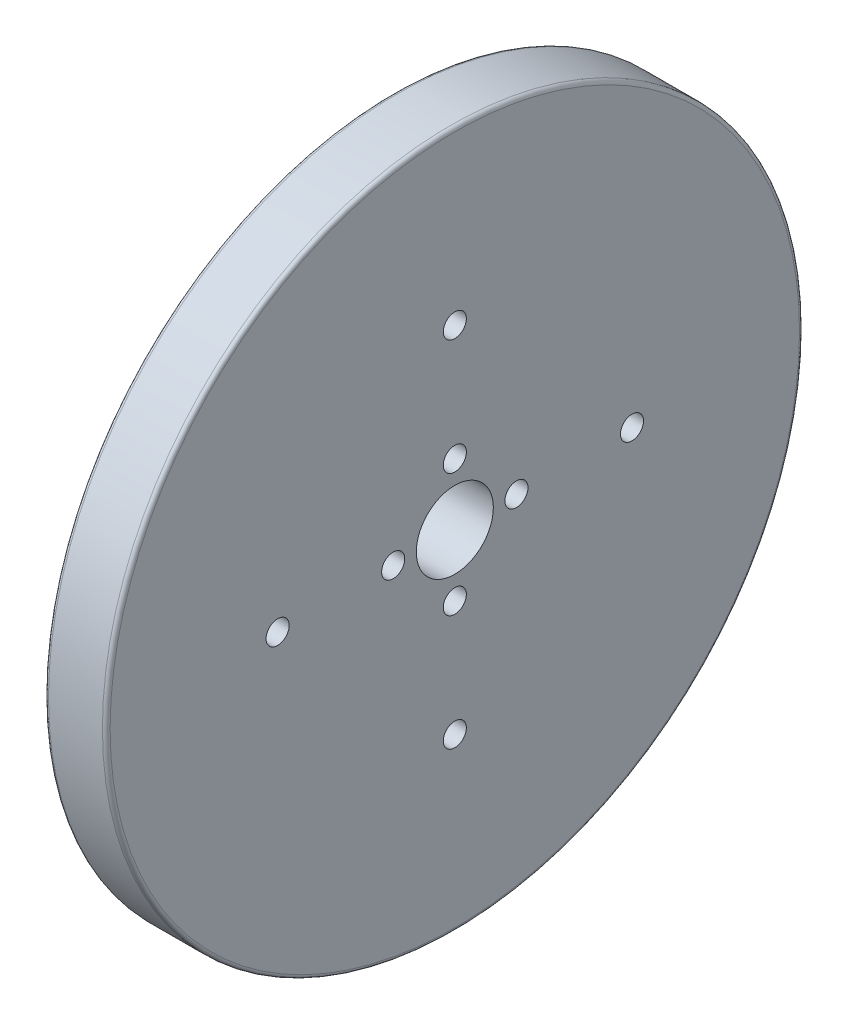
ISO-10303-21;
HEADER;
FILE_DESCRIPTION(('STEP AP214'),'2;1');
FILE_NAME('part.step','',(''),(''),'','','');
FILE_SCHEMA(('AUTOMOTIVE_DESIGN { 1 0 10303 214 1 1 1 1 }'));
ENDSEC;
DATA;
#1=APPLICATION_CONTEXT('core data for automotive mechanical design processes');
#2=APPLICATION_PROTOCOL_DEFINITION('international standard','automotive_design',2000,#1);
#3=PRODUCT_CONTEXT('',#1,'mechanical');
#4=PRODUCT('Part','Part','',(#3));
#5=PRODUCT_RELATED_PRODUCT_CATEGORY('part','',(#4));
#6=PRODUCT_DEFINITION_FORMATION('','',#4);
#7=PRODUCT_DEFINITION_CONTEXT('part definition',#1,'design');
#8=PRODUCT_DEFINITION('design','',#6,#7);
#9=PRODUCT_DEFINITION_SHAPE('','',#8);
#10=(LENGTH_UNIT() NAMED_UNIT(*) SI_UNIT(.MILLI.,.METRE.));
#11=(NAMED_UNIT(*) PLANE_ANGLE_UNIT() SI_UNIT($,.RADIAN.));
#12=(NAMED_UNIT(*) SI_UNIT($,.STERADIAN.) SOLID_ANGLE_UNIT());
#13=UNCERTAINTY_MEASURE_WITH_UNIT(LENGTH_MEASURE(1.E-05),#10,'distance_accuracy_value','');
#14=(GEOMETRIC_REPRESENTATION_CONTEXT(3) GLOBAL_UNCERTAINTY_ASSIGNED_CONTEXT((#13)) GLOBAL_UNIT_ASSIGNED_CONTEXT((#10,
#11,#12)) REPRESENTATION_CONTEXT('',''));
#15=CARTESIAN_POINT('',(0.,0.,0.));
#16=DIRECTION('',(0.,0.,1.));
#17=DIRECTION('',(1.,0.,0.));
#18=AXIS2_PLACEMENT_3D('',#15,#16,#17);
#19=CARTESIAN_POINT('',(8.,0.,0.));
#20=DIRECTION('',(-1.,0.,0.));
#21=DIRECTION('',(0.,0.,1.));
#22=AXIS2_PLACEMENT_3D('',#19,#20,#21);
#23=CYLINDRICAL_SURFACE('',#22,45.25);
#24=CARTESIAN_POINT('',(0.5,0.,0.));
#25=DIRECTION('',(1.,0.,0.));
#26=DIRECTION('',(0.,0.,-1.));
#27=AXIS2_PLACEMENT_3D('',#24,#25,#26);
#28=CIRCLE('',#27,45.25);
#29=CARTESIAN_POINT('',(0.5,0.,-45.25));
#30=VERTEX_POINT('',#29);
#31=EDGE_CURVE('E44',#30,#30,#28,.T.);
#32=ORIENTED_EDGE('',*,*,#31,.T.);
#33=EDGE_LOOP('',(#32));
#34=FACE_BOUND('',#33,.T.);
#35=CARTESIAN_POINT('',(7.5,0.,0.));
#36=DIRECTION('',(1.,0.,0.));
#37=DIRECTION('',(0.,0.,-1.));
#38=AXIS2_PLACEMENT_3D('',#35,#36,#37);
#39=CIRCLE('',#38,45.25);
#40=CARTESIAN_POINT('',(7.5,0.,-45.25));
#41=VERTEX_POINT('',#40);
#42=EDGE_CURVE('E48',#41,#41,#39,.F.);
#43=ORIENTED_EDGE('',*,*,#42,.T.);
#44=EDGE_LOOP('',(#43));
#45=FACE_BOUND('',#44,.T.);
#46=ADVANCED_FACE('F33',(#34,#45),#23,.T.);
#47=CARTESIAN_POINT('',(8.,0.,0.));
#48=DIRECTION('',(1.,0.,0.));
#49=DIRECTION('',(0.,0.,-1.));
#50=AXIS2_PLACEMENT_3D('',#47,#48,#49);
#51=PLANE('',#50);
#52=CARTESIAN_POINT('',(8.,0.,0.));
#53=DIRECTION('',(1.,0.,0.));
#54=DIRECTION('',(0.,0.,-1.));
#55=AXIS2_PLACEMENT_3D('',#52,#53,#54);
#56=CIRCLE('',#55,44.75);
#57=CARTESIAN_POINT('',(8.,0.,-44.75));
#58=VERTEX_POINT('',#57);
#59=EDGE_CURVE('E10',#58,#58,#56,.T.);
#60=ORIENTED_EDGE('',*,*,#59,.T.);
#61=EDGE_LOOP('',(#60));
#62=FACE_BOUND('',#61,.T.);
#63=CARTESIAN_POINT('',(8.,-6.53699316899292E-13,22.9999999999993));
#64=DIRECTION('',(1.,0.,0.));
#65=DIRECTION('',(0.,0.,-1.));
#66=AXIS2_PLACEMENT_3D('',#63,#64,#65);
#67=CIRCLE('',#66,1.50000000000105);
#68=CARTESIAN_POINT('',(8.,-6.53699316899292E-13,21.4999999999983));
#69=VERTEX_POINT('',#68);
#70=EDGE_CURVE('E99',#69,#69,#67,.T.);
#71=ORIENTED_EDGE('',*,*,#70,.F.);
#72=EDGE_LOOP('',(#71));
#73=FACE_BOUND('',#72,.T.);
#74=CARTESIAN_POINT('',(8.,0.,8.));
#75=DIRECTION('',(1.,0.,0.));
#76=DIRECTION('',(0.,0.,-1.));
#77=AXIS2_PLACEMENT_3D('',#74,#75,#76);
#78=CIRCLE('',#77,1.5);
#79=CARTESIAN_POINT('',(8.,0.,6.5));
#80=VERTEX_POINT('',#79);
#81=EDGE_CURVE('E93',#80,#80,#78,.T.);
#82=ORIENTED_EDGE('',*,*,#81,.F.);
#83=EDGE_LOOP('',(#82));
#84=FACE_BOUND('',#83,.T.);
#85=CARTESIAN_POINT('',(8.,-23.,-1.30035691470349E-12));
#86=DIRECTION('',(1.,0.,0.));
#87=DIRECTION('',(0.,0.,-1.));
#88=AXIS2_PLACEMENT_3D('',#85,#86,#87);
#89=CIRCLE('',#88,1.5000000000014);
#90=CARTESIAN_POINT('',(8.,-23.,-1.5000000000027));
#91=VERTEX_POINT('',#90);
#92=EDGE_CURVE('E87',#91,#91,#89,.T.);
#93=ORIENTED_EDGE('',*,*,#92,.F.);
#94=EDGE_LOOP('',(#93));
#95=FACE_BOUND('',#94,.T.);
#96=CARTESIAN_POINT('',(8.,-8.,0.));
#97=DIRECTION('',(1.,0.,0.));
#98=DIRECTION('',(0.,0.,-1.));
#99=AXIS2_PLACEMENT_3D('',#96,#97,#98);
#100=CIRCLE('',#99,1.5);
#101=CARTESIAN_POINT('',(8.,-8.,-1.49999999999994));
#102=VERTEX_POINT('',#101);
#103=EDGE_CURVE('E81',#102,#102,#100,.T.);
#104=ORIENTED_EDGE('',*,*,#103,.F.);
#105=EDGE_LOOP('',(#104));
#106=FACE_BOUND('',#105,.T.);
#107=CARTESIAN_POINT('',(8.,0.,-23.));
#108=DIRECTION('',(1.,0.,0.));
#109=DIRECTION('',(0.,0.,-1.));
#110=AXIS2_PLACEMENT_3D('',#107,#108,#109);
#111=CIRCLE('',#110,1.5);
#112=CARTESIAN_POINT('',(8.,0.,-24.5));
#113=VERTEX_POINT('',#112);
#114=EDGE_CURVE('E75',#113,#113,#111,.T.);
#115=ORIENTED_EDGE('',*,*,#114,.F.);
#116=EDGE_LOOP('',(#115));
#117=FACE_BOUND('',#116,.T.);
#118=CARTESIAN_POINT('',(8.,0.,-8.));
#119=DIRECTION('',(1.,0.,0.));
#120=DIRECTION('',(0.,0.,-1.));
#121=AXIS2_PLACEMENT_3D('',#118,#119,#120);
#122=CIRCLE('',#121,1.5);
#123=CARTESIAN_POINT('',(8.,0.,-9.5));
#124=VERTEX_POINT('',#123);
#125=EDGE_CURVE('E69',#124,#124,#122,.T.);
#126=ORIENTED_EDGE('',*,*,#125,.F.);
#127=EDGE_LOOP('',(#126));
#128=FACE_BOUND('',#127,.T.);
#129=CARTESIAN_POINT('',(8.,8.,0.));
#130=DIRECTION('',(1.,0.,0.));
#131=DIRECTION('',(0.,0.,-1.));
#132=AXIS2_PLACEMENT_3D('',#129,#130,#131);
#133=CIRCLE('',#132,1.5);
#134=CARTESIAN_POINT('',(8.,8.,-1.5));
#135=VERTEX_POINT('',#134);
#136=EDGE_CURVE('E63',#135,#135,#133,.T.);
#137=ORIENTED_EDGE('',*,*,#136,.F.);
#138=EDGE_LOOP('',(#137));
#139=FACE_BOUND('',#138,.T.);
#140=CARTESIAN_POINT('',(8.,23.,0.));
#141=DIRECTION('',(1.,0.,0.));
#142=DIRECTION('',(0.,0.,-1.));
#143=AXIS2_PLACEMENT_3D('',#140,#141,#142);
#144=CIRCLE('',#143,1.5);
#145=CARTESIAN_POINT('',(8.,23.,-1.5));
#146=VERTEX_POINT('',#145);
#147=EDGE_CURVE('E57',#146,#146,#144,.T.);
#148=ORIENTED_EDGE('',*,*,#147,.F.);
#149=EDGE_LOOP('',(#148));
#150=FACE_BOUND('',#149,.T.);
#151=CARTESIAN_POINT('',(8.,0.,0.));
#152=DIRECTION('',(1.,0.,0.));
#153=DIRECTION('',(0.,0.,-1.));
#154=AXIS2_PLACEMENT_3D('',#151,#152,#153);
#155=CIRCLE('',#154,5.);
#156=CARTESIAN_POINT('',(8.,0.,-5.));
#157=VERTEX_POINT('',#156);
#158=EDGE_CURVE('E53',#157,#157,#155,.T.);
#159=ORIENTED_EDGE('',*,*,#158,.F.);
#160=EDGE_LOOP('',(#159));
#161=FACE_BOUND('',#160,.T.);
#162=ADVANCED_FACE('F111',(#62,#73,#84,#95,#106,#117,#128,#139,#150,#161),#51,.T.);
#163=CARTESIAN_POINT('',(0.,0.,0.));
#164=DIRECTION('',(1.,0.,0.));
#165=DIRECTION('',(0.,0.,-1.));
#166=AXIS2_PLACEMENT_3D('',#163,#164,#165);
#167=PLANE('',#166);
#168=CARTESIAN_POINT('',(0.,0.,0.));
#169=DIRECTION('',(1.,0.,0.));
#170=DIRECTION('',(0.,0.,-1.));
#171=AXIS2_PLACEMENT_3D('',#168,#169,#170);
#172=CIRCLE('',#171,44.75);
#173=CARTESIAN_POINT('',(0.,0.,-44.75));
#174=VERTEX_POINT('',#173);
#175=EDGE_CURVE('E40',#174,#174,#172,.F.);
#176=ORIENTED_EDGE('',*,*,#175,.T.);
#177=EDGE_LOOP('',(#176));
#178=FACE_BOUND('',#177,.T.);
#179=CARTESIAN_POINT('',(0.,-6.53699316899292E-13,22.9999999999993));
#180=DIRECTION('',(1.,0.,0.));
#181=DIRECTION('',(0.,0.,-1.));
#182=AXIS2_PLACEMENT_3D('',#179,#180,#181);
#183=CIRCLE('',#182,1.50000000000105);
#184=CARTESIAN_POINT('',(0.,-6.53699316899292E-13,21.4999999999983));
#185=VERTEX_POINT('',#184);
#186=EDGE_CURVE('E102',#185,#185,#183,.T.);
#187=ORIENTED_EDGE('',*,*,#186,.T.);
#188=EDGE_LOOP('',(#187));
#189=FACE_BOUND('',#188,.T.);
#190=CARTESIAN_POINT('',(0.,0.,8.));
#191=DIRECTION('',(1.,0.,0.));
#192=DIRECTION('',(0.,0.,-1.));
#193=AXIS2_PLACEMENT_3D('',#190,#191,#192);
#194=CIRCLE('',#193,1.5);
#195=CARTESIAN_POINT('',(0.,0.,6.5));
#196=VERTEX_POINT('',#195);
#197=EDGE_CURVE('E96',#196,#196,#194,.T.);
#198=ORIENTED_EDGE('',*,*,#197,.T.);
#199=EDGE_LOOP('',(#198));
#200=FACE_BOUND('',#199,.T.);
#201=CARTESIAN_POINT('',(0.,-23.,-1.30035691470349E-12));
#202=DIRECTION('',(1.,0.,0.));
#203=DIRECTION('',(0.,0.,-1.));
#204=AXIS2_PLACEMENT_3D('',#201,#202,#203);
#205=CIRCLE('',#204,1.5000000000014);
#206=CARTESIAN_POINT('',(0.,-23.,-1.5000000000027));
#207=VERTEX_POINT('',#206);
#208=EDGE_CURVE('E90',#207,#207,#205,.T.);
#209=ORIENTED_EDGE('',*,*,#208,.T.);
#210=EDGE_LOOP('',(#209));
#211=FACE_BOUND('',#210,.T.);
#212=CARTESIAN_POINT('',(0.,-8.,0.));
#213=DIRECTION('',(1.,0.,0.));
#214=DIRECTION('',(0.,0.,-1.));
#215=AXIS2_PLACEMENT_3D('',#212,#213,#214);
#216=CIRCLE('',#215,1.5);
#217=CARTESIAN_POINT('',(0.,-8.,-1.49999999999994));
#218=VERTEX_POINT('',#217);
#219=EDGE_CURVE('E84',#218,#218,#216,.T.);
#220=ORIENTED_EDGE('',*,*,#219,.T.);
#221=EDGE_LOOP('',(#220));
#222=FACE_BOUND('',#221,.T.);
#223=CARTESIAN_POINT('',(0.,0.,-23.));
#224=DIRECTION('',(1.,0.,0.));
#225=DIRECTION('',(0.,0.,-1.));
#226=AXIS2_PLACEMENT_3D('',#223,#224,#225);
#227=CIRCLE('',#226,1.5);
#228=CARTESIAN_POINT('',(0.,0.,-24.5));
#229=VERTEX_POINT('',#228);
#230=EDGE_CURVE('E78',#229,#229,#227,.T.);
#231=ORIENTED_EDGE('',*,*,#230,.T.);
#232=EDGE_LOOP('',(#231));
#233=FACE_BOUND('',#232,.T.);
#234=CARTESIAN_POINT('',(0.,0.,-8.));
#235=DIRECTION('',(1.,0.,0.));
#236=DIRECTION('',(0.,0.,-1.));
#237=AXIS2_PLACEMENT_3D('',#234,#235,#236);
#238=CIRCLE('',#237,1.5);
#239=CARTESIAN_POINT('',(0.,0.,-9.5));
#240=VERTEX_POINT('',#239);
#241=EDGE_CURVE('E72',#240,#240,#238,.T.);
#242=ORIENTED_EDGE('',*,*,#241,.T.);
#243=EDGE_LOOP('',(#242));
#244=FACE_BOUND('',#243,.T.);
#245=CARTESIAN_POINT('',(0.,8.,0.));
#246=DIRECTION('',(1.,0.,0.));
#247=DIRECTION('',(0.,0.,-1.));
#248=AXIS2_PLACEMENT_3D('',#245,#246,#247);
#249=CIRCLE('',#248,1.5);
#250=CARTESIAN_POINT('',(0.,8.,-1.5));
#251=VERTEX_POINT('',#250);
#252=EDGE_CURVE('E66',#251,#251,#249,.T.);
#253=ORIENTED_EDGE('',*,*,#252,.T.);
#254=EDGE_LOOP('',(#253));
#255=FACE_BOUND('',#254,.T.);
#256=CARTESIAN_POINT('',(0.,23.,0.));
#257=DIRECTION('',(1.,0.,0.));
#258=DIRECTION('',(0.,0.,-1.));
#259=AXIS2_PLACEMENT_3D('',#256,#257,#258);
#260=CIRCLE('',#259,1.5);
#261=CARTESIAN_POINT('',(0.,23.,-1.5));
#262=VERTEX_POINT('',#261);
#263=EDGE_CURVE('E60',#262,#262,#260,.T.);
#264=ORIENTED_EDGE('',*,*,#263,.T.);
#265=EDGE_LOOP('',(#264));
#266=FACE_BOUND('',#265,.T.);
#267=CARTESIAN_POINT('',(0.,0.,0.));
#268=DIRECTION('',(1.,0.,0.));
#269=DIRECTION('',(0.,0.,-1.));
#270=AXIS2_PLACEMENT_3D('',#267,#268,#269);
#271=CIRCLE('',#270,5.);
#272=CARTESIAN_POINT('',(0.,0.,-5.));
#273=VERTEX_POINT('',#272);
#274=EDGE_CURVE('E54',#273,#273,#271,.T.);
#275=ORIENTED_EDGE('',*,*,#274,.T.);
#276=EDGE_LOOP('',(#275));
#277=FACE_BOUND('',#276,.T.);
#278=ADVANCED_FACE('F114',(#178,#189,#200,#211,#222,#233,#244,#255,#266,#277),#167,.F.);
#279=CARTESIAN_POINT('',(8.,0.,0.));
#280=DIRECTION('',(-1.,0.,0.));
#281=DIRECTION('',(0.,0.,1.));
#282=AXIS2_PLACEMENT_3D('',#279,#280,#281);
#283=CYLINDRICAL_SURFACE('',#282,5.);
#284=ORIENTED_EDGE('',*,*,#158,.T.);
#285=EDGE_LOOP('',(#284));
#286=FACE_BOUND('',#285,.T.);
#287=ORIENTED_EDGE('',*,*,#274,.F.);
#288=EDGE_LOOP('',(#287));
#289=FACE_BOUND('',#288,.T.);
#290=ADVANCED_FACE('F132',(#286,#289),#283,.F.);
#291=CARTESIAN_POINT('',(8.,23.,0.));
#292=DIRECTION('',(-1.,0.,0.));
#293=DIRECTION('',(0.,0.,1.));
#294=AXIS2_PLACEMENT_3D('',#291,#292,#293);
#295=CYLINDRICAL_SURFACE('',#294,1.5);
#296=ORIENTED_EDGE('',*,*,#147,.T.);
#297=EDGE_LOOP('',(#296));
#298=FACE_BOUND('',#297,.T.);
#299=ORIENTED_EDGE('',*,*,#263,.F.);
#300=EDGE_LOOP('',(#299));
#301=FACE_BOUND('',#300,.T.);
#302=ADVANCED_FACE('F135',(#298,#301),#295,.F.);
#303=CARTESIAN_POINT('',(8.,8.,0.));
#304=DIRECTION('',(-1.,0.,0.));
#305=DIRECTION('',(0.,0.,1.));
#306=AXIS2_PLACEMENT_3D('',#303,#304,#305);
#307=CYLINDRICAL_SURFACE('',#306,1.5);
#308=ORIENTED_EDGE('',*,*,#136,.T.);
#309=EDGE_LOOP('',(#308));
#310=FACE_BOUND('',#309,.T.);
#311=ORIENTED_EDGE('',*,*,#252,.F.);
#312=EDGE_LOOP('',(#311));
#313=FACE_BOUND('',#312,.T.);
#314=ADVANCED_FACE('F183',(#310,#313),#307,.F.);
#315=CARTESIAN_POINT('',(8.,0.,-8.));
#316=DIRECTION('',(-1.,0.,0.));
#317=DIRECTION('',(0.,0.,1.));
#318=AXIS2_PLACEMENT_3D('',#315,#316,#317);
#319=CYLINDRICAL_SURFACE('',#318,1.5);
#320=ORIENTED_EDGE('',*,*,#125,.T.);
#321=EDGE_LOOP('',(#320));
#322=FACE_BOUND('',#321,.T.);
#323=ORIENTED_EDGE('',*,*,#241,.F.);
#324=EDGE_LOOP('',(#323));
#325=FACE_BOUND('',#324,.T.);
#326=ADVANCED_FACE('F179',(#322,#325),#319,.F.);
#327=CARTESIAN_POINT('',(8.,0.,-23.));
#328=DIRECTION('',(-1.,0.,0.));
#329=DIRECTION('',(0.,0.,1.));
#330=AXIS2_PLACEMENT_3D('',#327,#328,#329);
#331=CYLINDRICAL_SURFACE('',#330,1.5);
#332=ORIENTED_EDGE('',*,*,#114,.T.);
#333=EDGE_LOOP('',(#332));
#334=FACE_BOUND('',#333,.T.);
#335=ORIENTED_EDGE('',*,*,#230,.F.);
#336=EDGE_LOOP('',(#335));
#337=FACE_BOUND('',#336,.T.);
#338=ADVANCED_FACE('F175',(#334,#337),#331,.F.);
#339=CARTESIAN_POINT('',(8.,-8.,0.));
#340=DIRECTION('',(-1.,0.,0.));
#341=DIRECTION('',(0.,0.,1.));
#342=AXIS2_PLACEMENT_3D('',#339,#340,#341);
#343=CYLINDRICAL_SURFACE('',#342,1.5);
#344=ORIENTED_EDGE('',*,*,#103,.T.);
#345=EDGE_LOOP('',(#344));
#346=FACE_BOUND('',#345,.T.);
#347=ORIENTED_EDGE('',*,*,#219,.F.);
#348=EDGE_LOOP('',(#347));
#349=FACE_BOUND('',#348,.T.);
#350=ADVANCED_FACE('F171',(#346,#349),#343,.F.);
#351=CARTESIAN_POINT('',(8.,-23.,-1.30035691470349E-12));
#352=DIRECTION('',(-1.,0.,0.));
#353=DIRECTION('',(0.,0.,1.));
#354=AXIS2_PLACEMENT_3D('',#351,#352,#353);
#355=CYLINDRICAL_SURFACE('',#354,1.5000000000014);
#356=ORIENTED_EDGE('',*,*,#92,.T.);
#357=EDGE_LOOP('',(#356));
#358=FACE_BOUND('',#357,.T.);
#359=ORIENTED_EDGE('',*,*,#208,.F.);
#360=EDGE_LOOP('',(#359));
#361=FACE_BOUND('',#360,.T.);
#362=ADVANCED_FACE('F165',(#358,#361),#355,.F.);
#363=CARTESIAN_POINT('',(8.,0.,8.));
#364=DIRECTION('',(-1.,0.,0.));
#365=DIRECTION('',(0.,0.,1.));
#366=AXIS2_PLACEMENT_3D('',#363,#364,#365);
#367=CYLINDRICAL_SURFACE('',#366,1.5);
#368=ORIENTED_EDGE('',*,*,#81,.T.);
#369=EDGE_LOOP('',(#368));
#370=FACE_BOUND('',#369,.T.);
#371=ORIENTED_EDGE('',*,*,#197,.F.);
#372=EDGE_LOOP('',(#371));
#373=FACE_BOUND('',#372,.T.);
#374=ADVANCED_FACE('F158',(#370,#373),#367,.F.);
#375=CARTESIAN_POINT('',(8.,-6.53699316899292E-13,22.9999999999993));
#376=DIRECTION('',(-1.,0.,0.));
#377=DIRECTION('',(0.,0.,1.));
#378=AXIS2_PLACEMENT_3D('',#375,#376,#377);
#379=CYLINDRICAL_SURFACE('',#378,1.50000000000105);
#380=ORIENTED_EDGE('',*,*,#70,.T.);
#381=EDGE_LOOP('',(#380));
#382=FACE_BOUND('',#381,.T.);
#383=ORIENTED_EDGE('',*,*,#186,.F.);
#384=EDGE_LOOP('',(#383));
#385=FACE_BOUND('',#384,.T.);
#386=ADVANCED_FACE('F108',(#382,#385),#379,.F.);
#387=CARTESIAN_POINT('',(0.5,0.,0.));
#388=DIRECTION('',(1.,0.,0.));
#389=DIRECTION('',(0.,0.,-1.));
#390=AXIS2_PLACEMENT_3D('',#387,#388,#389);
#391=TOROIDAL_SURFACE('',#390,44.75,0.5);
#392=ORIENTED_EDGE('',*,*,#175,.F.);
#393=EDGE_LOOP('',(#392));
#394=FACE_BOUND('',#393,.T.);
#395=ORIENTED_EDGE('',*,*,#31,.F.);
#396=EDGE_LOOP('',(#395));
#397=FACE_BOUND('',#396,.T.);
#398=ADVANCED_FACE('F150',(#394,#397),#391,.T.);
#399=CARTESIAN_POINT('',(7.5,0.,0.));
#400=DIRECTION('',(1.,0.,0.));
#401=DIRECTION('',(0.,0.,-1.));
#402=AXIS2_PLACEMENT_3D('',#399,#400,#401);
#403=TOROIDAL_SURFACE('',#402,44.75,0.5);
#404=ORIENTED_EDGE('',*,*,#42,.F.);
#405=EDGE_LOOP('',(#404));
#406=FACE_BOUND('',#405,.T.);
#407=ORIENTED_EDGE('',*,*,#59,.F.);
#408=EDGE_LOOP('',(#407));
#409=FACE_BOUND('',#408,.T.);
#410=ADVANCED_FACE('F35',(#406,#409),#403,.T.);
#411=CLOSED_SHELL('',(#46,#162,#278,#290,#302,#314,#326,#338,#350,#362,#374,#386,#398,#410));
#412=MANIFOLD_SOLID_BREP('B2',#411);
#413=ADVANCED_BREP_SHAPE_REPRESENTATION('',(#18,#412),#14);
#414=SHAPE_DEFINITION_REPRESENTATION(#9,#413);
ENDSEC;
END-ISO-10303-21;
